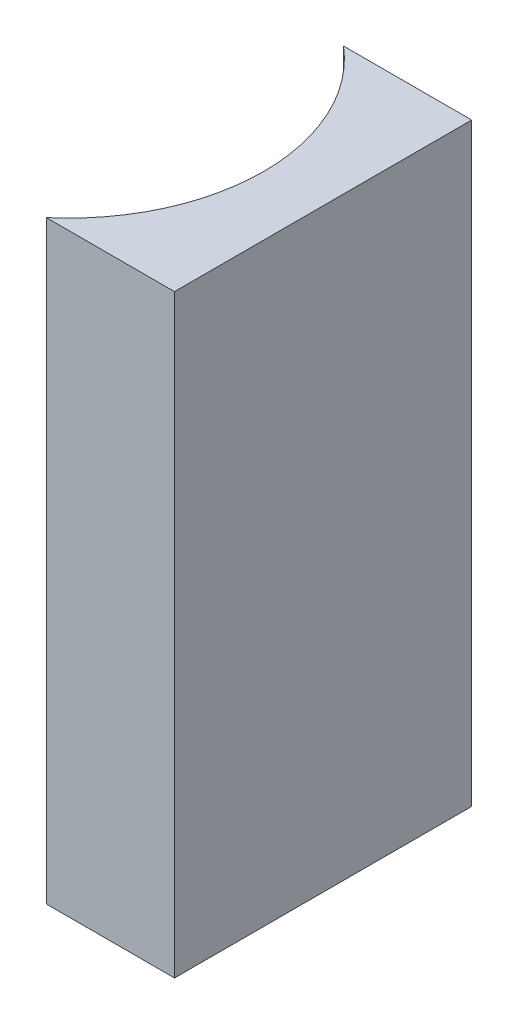
ISO-10303-21;
HEADER;
FILE_DESCRIPTION(('STEP AP214'),'2;1');
FILE_NAME('part.step','',(''),(''),'','','');
FILE_SCHEMA(('AUTOMOTIVE_DESIGN { 1 0 10303 214 1 1 1 1 }'));
ENDSEC;
DATA;
#1=APPLICATION_CONTEXT('core data for automotive mechanical design processes');
#2=APPLICATION_PROTOCOL_DEFINITION('international standard','automotive_design',2000,#1);
#3=PRODUCT_CONTEXT('',#1,'mechanical');
#4=PRODUCT('Part','Part','',(#3));
#5=PRODUCT_RELATED_PRODUCT_CATEGORY('part','',(#4));
#6=PRODUCT_DEFINITION_FORMATION('','',#4);
#7=PRODUCT_DEFINITION_CONTEXT('part definition',#1,'design');
#8=PRODUCT_DEFINITION('design','',#6,#7);
#9=PRODUCT_DEFINITION_SHAPE('','',#8);
#10=(LENGTH_UNIT() NAMED_UNIT(*) SI_UNIT(.MILLI.,.METRE.));
#11=(NAMED_UNIT(*) PLANE_ANGLE_UNIT() SI_UNIT($,.RADIAN.));
#12=(NAMED_UNIT(*) SI_UNIT($,.STERADIAN.) SOLID_ANGLE_UNIT());
#13=UNCERTAINTY_MEASURE_WITH_UNIT(LENGTH_MEASURE(1.E-05),#10,'distance_accuracy_value','');
#14=(GEOMETRIC_REPRESENTATION_CONTEXT(3) GLOBAL_UNCERTAINTY_ASSIGNED_CONTEXT((#13)) GLOBAL_UNIT_ASSIGNED_CONTEXT((#10,
#11,#12)) REPRESENTATION_CONTEXT('',''));
#15=CARTESIAN_POINT('',(0.,0.,0.));
#16=DIRECTION('',(0.,0.,1.));
#17=DIRECTION('',(1.,0.,0.));
#18=AXIS2_PLACEMENT_3D('',#15,#16,#17);
#19=CARTESIAN_POINT('',(0.,20.,0.));
#20=DIRECTION('',(0.,0.,1.));
#21=DIRECTION('',(1.,0.,0.));
#22=AXIS2_PLACEMENT_3D('',#19,#20,#21);
#23=PLANE('',#22);
#24=DIRECTION('',(-1.,0.,0.));
#25=VECTOR('',#24,1.);
#26=CARTESIAN_POINT('',(0.,0.,0.));
#27=LINE('',#26,#25);
#28=CARTESIAN_POINT('',(0.,0.,0.));
#29=VERTEX_POINT('',#28);
#30=CARTESIAN_POINT('',(-4.31340136108909,0.,0.));
#31=VERTEX_POINT('',#30);
#32=EDGE_CURVE('E100',#29,#31,#27,.T.);
#33=ORIENTED_EDGE('',*,*,#32,.T.);
#34=DIRECTION('',(0.,-1.,0.));
#35=VECTOR('',#34,1.);
#36=CARTESIAN_POINT('',(-4.31340136108909,20.,0.));
#37=LINE('',#36,#35);
#38=CARTESIAN_POINT('',(-4.31340136108909,20.,0.));
#39=VERTEX_POINT('',#38);
#40=EDGE_CURVE('E11',#39,#31,#37,.T.);
#41=ORIENTED_EDGE('',*,*,#40,.F.);
#42=DIRECTION('',(-1.,0.,0.));
#43=VECTOR('',#42,1.);
#44=CARTESIAN_POINT('',(0.,20.,0.));
#45=LINE('',#44,#43);
#46=CARTESIAN_POINT('',(0.,20.,0.));
#47=VERTEX_POINT('',#46);
#48=EDGE_CURVE('E88',#47,#39,#45,.T.);
#49=ORIENTED_EDGE('',*,*,#48,.F.);
#50=DIRECTION('',(0.,-1.,0.));
#51=VECTOR('',#50,1.);
#52=CARTESIAN_POINT('',(0.,20.,0.));
#53=LINE('',#52,#51);
#54=EDGE_CURVE('E96',#47,#29,#53,.T.);
#55=ORIENTED_EDGE('',*,*,#54,.T.);
#56=EDGE_LOOP('',(#33,#41,#49,#55));
#57=FACE_BOUND('',#56,.T.);
#58=ADVANCED_FACE('F37',(#57),#23,.F.);
#59=CARTESIAN_POINT('',(-8.56,20.,5.));
#60=DIRECTION('',(0.,-1.,0.));
#61=DIRECTION('',(0.,0.,-1.));
#62=AXIS2_PLACEMENT_3D('',#59,#60,#61);
#63=CYLINDRICAL_SURFACE('',#62,6.56);
#64=CARTESIAN_POINT('',(-8.56,0.,5.));
#65=DIRECTION('',(0.,-1.,0.));
#66=DIRECTION('',(0.,0.,1.));
#67=AXIS2_PLACEMENT_3D('',#64,#65,#66);
#68=CIRCLE('',#67,6.56);
#69=CARTESIAN_POINT('',(-4.31340136108909,0.,10.));
#70=VERTEX_POINT('',#69);
#71=EDGE_CURVE('E92',#31,#70,#68,.T.);
#72=ORIENTED_EDGE('',*,*,#71,.T.);
#73=DIRECTION('',(0.,-1.,0.));
#74=VECTOR('',#73,1.);
#75=CARTESIAN_POINT('',(-4.31340136108909,20.,10.));
#76=LINE('',#75,#74);
#77=CARTESIAN_POINT('',(-4.31340136108909,20.,10.));
#78=VERTEX_POINT('',#77);
#79=EDGE_CURVE('E45',#78,#70,#76,.T.);
#80=ORIENTED_EDGE('',*,*,#79,.F.);
#81=CARTESIAN_POINT('',(-8.56,20.,5.));
#82=DIRECTION('',(0.,-1.,0.));
#83=DIRECTION('',(0.,0.,1.));
#84=AXIS2_PLACEMENT_3D('',#81,#82,#83);
#85=CIRCLE('',#84,6.56);
#86=EDGE_CURVE('E83',#39,#78,#85,.T.);
#87=ORIENTED_EDGE('',*,*,#86,.F.);
#88=ORIENTED_EDGE('',*,*,#40,.T.);
#89=EDGE_LOOP('',(#72,#80,#87,#88));
#90=FACE_BOUND('',#89,.T.);
#91=ADVANCED_FACE('F91',(#90),#63,.F.);
#92=CARTESIAN_POINT('',(0.,20.,10.));
#93=DIRECTION('',(0.,0.,-1.));
#94=DIRECTION('',(-1.,0.,0.));
#95=AXIS2_PLACEMENT_3D('',#92,#93,#94);
#96=PLANE('',#95);
#97=DIRECTION('',(1.,0.,0.));
#98=VECTOR('',#97,1.);
#99=CARTESIAN_POINT('',(0.,0.,10.));
#100=LINE('',#99,#98);
#101=CARTESIAN_POINT('',(0.,0.,10.));
#102=VERTEX_POINT('',#101);
#103=EDGE_CURVE('E70',#70,#102,#100,.T.);
#104=ORIENTED_EDGE('',*,*,#103,.T.);
#105=DIRECTION('',(0.,-1.,0.));
#106=VECTOR('',#105,1.);
#107=CARTESIAN_POINT('',(0.,20.,10.));
#108=LINE('',#107,#106);
#109=CARTESIAN_POINT('',(0.,20.,10.));
#110=VERTEX_POINT('',#109);
#111=EDGE_CURVE('E93',#110,#102,#108,.T.);
#112=ORIENTED_EDGE('',*,*,#111,.F.);
#113=DIRECTION('',(1.,0.,0.));
#114=VECTOR('',#113,1.);
#115=CARTESIAN_POINT('',(0.,20.,10.));
#116=LINE('',#115,#114);
#117=EDGE_CURVE('E86',#78,#110,#116,.T.);
#118=ORIENTED_EDGE('',*,*,#117,.F.);
#119=ORIENTED_EDGE('',*,*,#79,.T.);
#120=EDGE_LOOP('',(#104,#112,#118,#119));
#121=FACE_BOUND('',#120,.T.);
#122=ADVANCED_FACE('F94',(#121),#96,.F.);
#123=CARTESIAN_POINT('',(0.,20.,0.));
#124=DIRECTION('',(-1.,0.,0.));
#125=DIRECTION('',(0.,0.,1.));
#126=AXIS2_PLACEMENT_3D('',#123,#124,#125);
#127=PLANE('',#126);
#128=DIRECTION('',(0.,0.,-1.));
#129=VECTOR('',#128,1.);
#130=CARTESIAN_POINT('',(0.,0.,0.));
#131=LINE('',#130,#129);
#132=EDGE_CURVE('E76',#102,#29,#131,.T.);
#133=ORIENTED_EDGE('',*,*,#132,.T.);
#134=ORIENTED_EDGE('',*,*,#54,.F.);
#135=DIRECTION('',(0.,0.,-1.));
#136=VECTOR('',#135,1.);
#137=CARTESIAN_POINT('',(0.,20.,0.));
#138=LINE('',#137,#136);
#139=EDGE_CURVE('E53',#110,#47,#138,.T.);
#140=ORIENTED_EDGE('',*,*,#139,.F.);
#141=ORIENTED_EDGE('',*,*,#111,.T.);
#142=EDGE_LOOP('',(#133,#134,#140,#141));
#143=FACE_BOUND('',#142,.T.);
#144=ADVANCED_FACE('F107',(#143),#127,.F.);
#145=CARTESIAN_POINT('',(-8.56,20.,5.));
#146=DIRECTION('',(0.,1.,0.));
#147=DIRECTION('',(0.,0.,1.));
#148=AXIS2_PLACEMENT_3D('',#145,#146,#147);
#149=PLANE('',#148);
#150=ORIENTED_EDGE('',*,*,#48,.T.);
#151=ORIENTED_EDGE('',*,*,#86,.T.);
#152=ORIENTED_EDGE('',*,*,#117,.T.);
#153=ORIENTED_EDGE('',*,*,#139,.T.);
#154=EDGE_LOOP('',(#150,#151,#152,#153));
#155=FACE_BOUND('',#154,.T.);
#156=ADVANCED_FACE('F84',(#155),#149,.T.);
#157=CARTESIAN_POINT('',(-8.56,0.,5.));
#158=DIRECTION('',(0.,1.,0.));
#159=DIRECTION('',(0.,0.,1.));
#160=AXIS2_PLACEMENT_3D('',#157,#158,#159);
#161=PLANE('',#160);
#162=ORIENTED_EDGE('',*,*,#32,.F.);
#163=ORIENTED_EDGE('',*,*,#132,.F.);
#164=ORIENTED_EDGE('',*,*,#103,.F.);
#165=ORIENTED_EDGE('',*,*,#71,.F.);
#166=EDGE_LOOP('',(#162,#163,#164,#165));
#167=FACE_BOUND('',#166,.T.);
#168=ADVANCED_FACE('F110',(#167),#161,.F.);
#169=CLOSED_SHELL('',(#58,#91,#122,#144,#156,#168));
#170=MANIFOLD_SOLID_BREP('B2',#169);
#171=ADVANCED_BREP_SHAPE_REPRESENTATION('',(#18,#170),#14);
#172=SHAPE_DEFINITION_REPRESENTATION(#9,#171);
ENDSEC;
END-ISO-10303-21;
